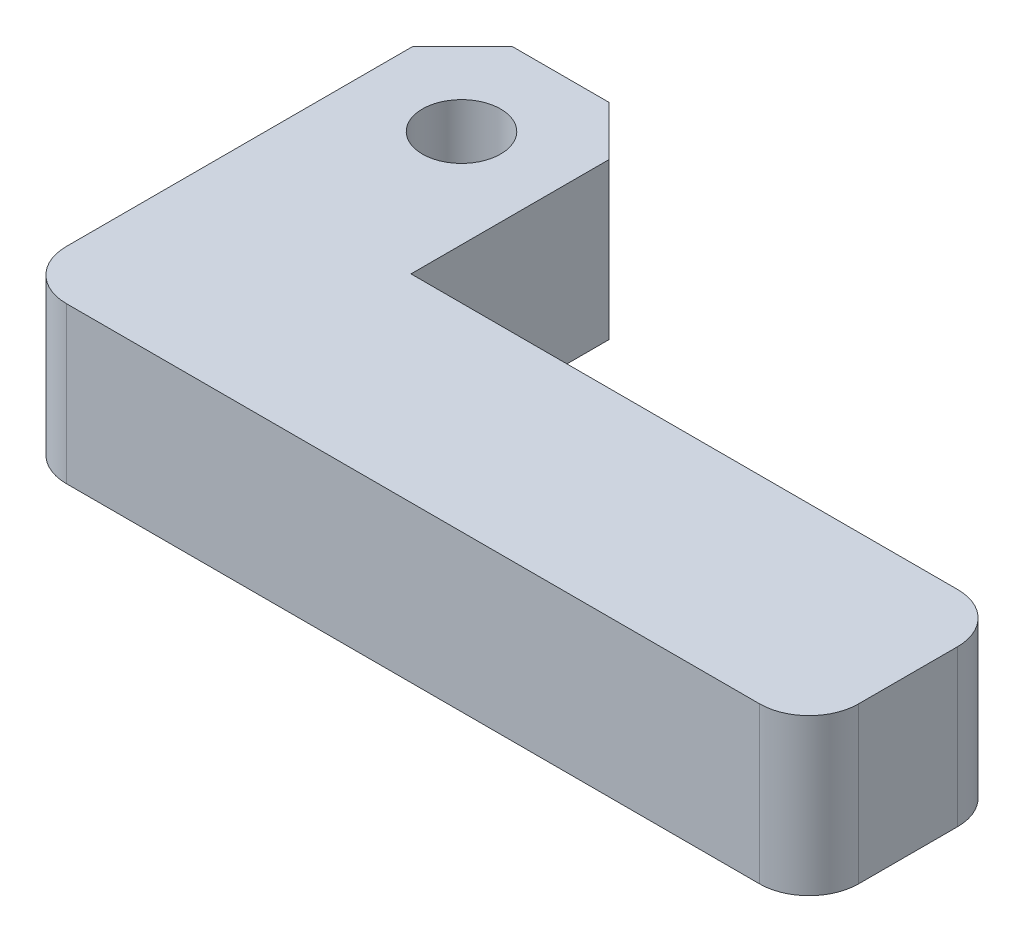
ISO-10303-21;
HEADER;
FILE_DESCRIPTION(('STEP AP214'),'2;1');
FILE_NAME('part.step','',(''),(''),'','','');
FILE_SCHEMA(('AUTOMOTIVE_DESIGN { 1 0 10303 214 1 1 1 1 }'));
ENDSEC;
DATA;
#1=APPLICATION_CONTEXT('core data for automotive mechanical design processes');
#2=APPLICATION_PROTOCOL_DEFINITION('international standard','automotive_design',2000,#1);
#3=PRODUCT_CONTEXT('',#1,'mechanical');
#4=PRODUCT('Part','Part','',(#3));
#5=PRODUCT_RELATED_PRODUCT_CATEGORY('part','',(#4));
#6=PRODUCT_DEFINITION_FORMATION('','',#4);
#7=PRODUCT_DEFINITION_CONTEXT('part definition',#1,'design');
#8=PRODUCT_DEFINITION('design','',#6,#7);
#9=PRODUCT_DEFINITION_SHAPE('','',#8);
#10=(LENGTH_UNIT() NAMED_UNIT(*) SI_UNIT(.MILLI.,.METRE.));
#11=(NAMED_UNIT(*) PLANE_ANGLE_UNIT() SI_UNIT($,.RADIAN.));
#12=(NAMED_UNIT(*) SI_UNIT($,.STERADIAN.) SOLID_ANGLE_UNIT());
#13=UNCERTAINTY_MEASURE_WITH_UNIT(LENGTH_MEASURE(1.E-05),#10,'distance_accuracy_value','');
#14=(GEOMETRIC_REPRESENTATION_CONTEXT(3) GLOBAL_UNCERTAINTY_ASSIGNED_CONTEXT((#13)) GLOBAL_UNIT_ASSIGNED_CONTEXT((#10,
#11,#12)) REPRESENTATION_CONTEXT('',''));
#15=CARTESIAN_POINT('',(0.,0.,0.));
#16=DIRECTION('',(0.,0.,1.));
#17=DIRECTION('',(1.,0.,0.));
#18=AXIS2_PLACEMENT_3D('',#15,#16,#17);
#19=CARTESIAN_POINT('',(47.625,10.,-3.175));
#20=DIRECTION('',(0.,1.,0.));
#21=DIRECTION('',(0.,0.,1.));
#22=AXIS2_PLACEMENT_3D('',#19,#20,#21);
#23=PLANE('',#22);
#24=DIRECTION('',(-1.,0.,0.));
#25=VECTOR('',#24,1.);
#26=CARTESIAN_POINT('',(12.573,10.,-28.575));
#27=LINE('',#26,#25);
#28=CARTESIAN_POINT('',(9.39799999999999,10.,-28.575));
#29=VERTEX_POINT('',#28);
#30=CARTESIAN_POINT('',(3.175,10.,-28.575));
#31=VERTEX_POINT('',#30);
#32=EDGE_CURVE('E171',#29,#31,#27,.T.);
#33=ORIENTED_EDGE('',*,*,#32,.T.);
#34=DIRECTION('',(0.707106781186549,0.,-0.707106781186546));
#35=VECTOR('',#34,1.);
#36=CARTESIAN_POINT('',(12.7000000000001,10.,-38.1));
#37=LINE('',#36,#35);
#38=CARTESIAN_POINT('',(0.,10.,-25.4));
#39=VERTEX_POINT('',#38);
#40=EDGE_CURVE('E41',#31,#39,#37,.F.);
#41=ORIENTED_EDGE('',*,*,#40,.T.);
#42=DIRECTION('',(0.,0.,1.));
#43=VECTOR('',#42,1.);
#44=CARTESIAN_POINT('',(0.,10.,-28.575));
#45=LINE('',#44,#43);
#46=CARTESIAN_POINT('',(0.,10.,-3.175));
#47=VERTEX_POINT('',#46);
#48=EDGE_CURVE('E128',#39,#47,#45,.T.);
#49=ORIENTED_EDGE('',*,*,#48,.T.);
#50=CARTESIAN_POINT('',(3.175,10.,-3.175));
#51=DIRECTION('',(0.,1.,0.));
#52=DIRECTION('',(0.,0.,1.));
#53=AXIS2_PLACEMENT_3D('',#50,#51,#52);
#54=CIRCLE('',#53,3.175);
#55=CARTESIAN_POINT('',(3.175,10.,0.));
#56=VERTEX_POINT('',#55);
#57=EDGE_CURVE('E124',#47,#56,#54,.T.);
#58=ORIENTED_EDGE('',*,*,#57,.T.);
#59=DIRECTION('',(1.,0.,0.));
#60=VECTOR('',#59,1.);
#61=CARTESIAN_POINT('',(0.,10.,0.));
#62=LINE('',#61,#60);
#63=CARTESIAN_POINT('',(47.625,10.,0.));
#64=VERTEX_POINT('',#63);
#65=EDGE_CURVE('E117',#56,#64,#62,.T.);
#66=ORIENTED_EDGE('',*,*,#65,.T.);
#67=CARTESIAN_POINT('',(47.625,10.,-3.175));
#68=DIRECTION('',(0.,1.,0.));
#69=DIRECTION('',(0.,0.,1.));
#70=AXIS2_PLACEMENT_3D('',#67,#68,#69);
#71=CIRCLE('',#70,3.175);
#72=CARTESIAN_POINT('',(50.8,10.,-3.175));
#73=VERTEX_POINT('',#72);
#74=EDGE_CURVE('E121',#64,#73,#71,.T.);
#75=ORIENTED_EDGE('',*,*,#74,.T.);
#76=DIRECTION('',(0.,0.,-1.));
#77=VECTOR('',#76,1.);
#78=CARTESIAN_POINT('',(50.8,10.,-3.175));
#79=LINE('',#78,#77);
#80=CARTESIAN_POINT('',(50.8,10.,-9.525));
#81=VERTEX_POINT('',#80);
#82=EDGE_CURVE('E143',#73,#81,#79,.T.);
#83=ORIENTED_EDGE('',*,*,#82,.T.);
#84=CARTESIAN_POINT('',(47.625,10.,-9.525));
#85=DIRECTION('',(0.,1.,0.));
#86=DIRECTION('',(0.,0.,1.));
#87=AXIS2_PLACEMENT_3D('',#84,#85,#86);
#88=CIRCLE('',#87,3.175);
#89=CARTESIAN_POINT('',(47.625,10.,-12.7));
#90=VERTEX_POINT('',#89);
#91=EDGE_CURVE('E145',#81,#90,#88,.T.);
#92=ORIENTED_EDGE('',*,*,#91,.T.);
#93=DIRECTION('',(-1.,0.,0.));
#94=VECTOR('',#93,1.);
#95=CARTESIAN_POINT('',(47.625,10.,-12.7));
#96=LINE('',#95,#94);
#97=CARTESIAN_POINT('',(12.573,10.,-12.7));
#98=VERTEX_POINT('',#97);
#99=EDGE_CURVE('E150',#90,#98,#96,.T.);
#100=ORIENTED_EDGE('',*,*,#99,.T.);
#101=DIRECTION('',(0.,0.,-1.));
#102=VECTOR('',#101,1.);
#103=CARTESIAN_POINT('',(12.573,10.,-12.7));
#104=LINE('',#103,#102);
#105=CARTESIAN_POINT('',(12.573,10.,-25.4));
#106=VERTEX_POINT('',#105);
#107=EDGE_CURVE('E152',#98,#106,#104,.T.);
#108=ORIENTED_EDGE('',*,*,#107,.T.);
#109=DIRECTION('',(0.707106781186546,0.,0.707106781186549));
#110=VECTOR('',#109,1.);
#111=CARTESIAN_POINT('',(41.2114999999999,10.,3.23850000000007));
#112=LINE('',#111,#110);
#113=EDGE_CURVE('E200',#106,#29,#112,.F.);
#114=ORIENTED_EDGE('',*,*,#113,.T.);
#115=EDGE_LOOP('',(#33,#41,#49,#58,#66,#75,#83,#92,#100,#108,#114));
#116=FACE_BOUND('',#115,.T.);
#117=CARTESIAN_POINT('',(6.2865,10.,-22.225));
#118=DIRECTION('',(0.,1.,0.));
#119=DIRECTION('',(0.,0.,1.));
#120=AXIS2_PLACEMENT_3D('',#117,#118,#119);
#121=CIRCLE('',#120,2.50825);
#122=CARTESIAN_POINT('',(6.2865,10.,-19.71675));
#123=VERTEX_POINT('',#122);
#124=EDGE_CURVE('E158',#123,#123,#121,.T.);
#125=ORIENTED_EDGE('',*,*,#124,.F.);
#126=EDGE_LOOP('',(#125));
#127=FACE_BOUND('',#126,.T.);
#128=ADVANCED_FACE('F33',(#116,#127),#23,.T.);
#129=CARTESIAN_POINT('',(47.625,0.,-3.175));
#130=DIRECTION('',(0.,1.,0.));
#131=DIRECTION('',(0.,0.,1.));
#132=AXIS2_PLACEMENT_3D('',#129,#130,#131);
#133=PLANE('',#132);
#134=DIRECTION('',(0.,0.,1.));
#135=VECTOR('',#134,1.);
#136=CARTESIAN_POINT('',(0.,0.,-28.575));
#137=LINE('',#136,#135);
#138=CARTESIAN_POINT('',(0.,0.,-25.4));
#139=VERTEX_POINT('',#138);
#140=CARTESIAN_POINT('',(0.,0.,-3.175));
#141=VERTEX_POINT('',#140);
#142=EDGE_CURVE('E157',#139,#141,#137,.T.);
#143=ORIENTED_EDGE('',*,*,#142,.F.);
#144=DIRECTION('',(-0.707106781186549,0.,0.707106781186546));
#145=VECTOR('',#144,1.);
#146=CARTESIAN_POINT('',(0.,0.,-25.4));
#147=LINE('',#146,#145);
#148=CARTESIAN_POINT('',(3.175,0.,-28.575));
#149=VERTEX_POINT('',#148);
#150=EDGE_CURVE('E194',#139,#149,#147,.F.);
#151=ORIENTED_EDGE('',*,*,#150,.T.);
#152=DIRECTION('',(-1.,0.,0.));
#153=VECTOR('',#152,1.);
#154=CARTESIAN_POINT('',(12.573,0.,-28.575));
#155=LINE('',#154,#153);
#156=CARTESIAN_POINT('',(9.39799999999999,0.,-28.575));
#157=VERTEX_POINT('',#156);
#158=EDGE_CURVE('E155',#157,#149,#155,.T.);
#159=ORIENTED_EDGE('',*,*,#158,.F.);
#160=DIRECTION('',(-0.707106781186546,0.,-0.707106781186549));
#161=VECTOR('',#160,1.);
#162=CARTESIAN_POINT('',(9.39799999999999,0.,-28.575));
#163=LINE('',#162,#161);
#164=CARTESIAN_POINT('',(12.573,0.,-25.4));
#165=VERTEX_POINT('',#164);
#166=EDGE_CURVE('E192',#157,#165,#163,.F.);
#167=ORIENTED_EDGE('',*,*,#166,.T.);
#168=DIRECTION('',(0.,0.,-1.));
#169=VECTOR('',#168,1.);
#170=CARTESIAN_POINT('',(12.573,0.,-12.7));
#171=LINE('',#170,#169);
#172=CARTESIAN_POINT('',(12.573,0.,-12.7));
#173=VERTEX_POINT('',#172);
#174=EDGE_CURVE('E169',#173,#165,#171,.T.);
#175=ORIENTED_EDGE('',*,*,#174,.F.);
#176=DIRECTION('',(-1.,0.,0.));
#177=VECTOR('',#176,1.);
#178=CARTESIAN_POINT('',(47.625,0.,-12.7));
#179=LINE('',#178,#177);
#180=CARTESIAN_POINT('',(47.625,0.,-12.7));
#181=VERTEX_POINT('',#180);
#182=EDGE_CURVE('E167',#181,#173,#179,.T.);
#183=ORIENTED_EDGE('',*,*,#182,.F.);
#184=CARTESIAN_POINT('',(47.625,0.,-9.525));
#185=DIRECTION('',(0.,1.,0.));
#186=DIRECTION('',(0.,0.,1.));
#187=AXIS2_PLACEMENT_3D('',#184,#185,#186);
#188=CIRCLE('',#187,3.175);
#189=CARTESIAN_POINT('',(50.8,0.,-9.525));
#190=VERTEX_POINT('',#189);
#191=EDGE_CURVE('E165',#190,#181,#188,.T.);
#192=ORIENTED_EDGE('',*,*,#191,.F.);
#193=DIRECTION('',(0.,0.,-1.));
#194=VECTOR('',#193,1.);
#195=CARTESIAN_POINT('',(50.8,0.,-3.175));
#196=LINE('',#195,#194);
#197=CARTESIAN_POINT('',(50.8,0.,-3.175));
#198=VERTEX_POINT('',#197);
#199=EDGE_CURVE('E163',#198,#190,#196,.T.);
#200=ORIENTED_EDGE('',*,*,#199,.F.);
#201=CARTESIAN_POINT('',(47.625,0.,-3.175));
#202=DIRECTION('',(0.,1.,0.));
#203=DIRECTION('',(0.,0.,1.));
#204=AXIS2_PLACEMENT_3D('',#201,#202,#203);
#205=CIRCLE('',#204,3.175);
#206=CARTESIAN_POINT('',(47.625,0.,0.));
#207=VERTEX_POINT('',#206);
#208=EDGE_CURVE('E161',#207,#198,#205,.T.);
#209=ORIENTED_EDGE('',*,*,#208,.F.);
#210=DIRECTION('',(1.,0.,0.));
#211=VECTOR('',#210,1.);
#212=CARTESIAN_POINT('',(0.,0.,0.));
#213=LINE('',#212,#211);
#214=CARTESIAN_POINT('',(3.175,0.,0.));
#215=VERTEX_POINT('',#214);
#216=EDGE_CURVE('E134',#215,#207,#213,.T.);
#217=ORIENTED_EDGE('',*,*,#216,.F.);
#218=CARTESIAN_POINT('',(3.175,0.,-3.175));
#219=DIRECTION('',(0.,1.,0.));
#220=DIRECTION('',(0.,0.,1.));
#221=AXIS2_PLACEMENT_3D('',#218,#219,#220);
#222=CIRCLE('',#221,3.175);
#223=EDGE_CURVE('E182',#215,#141,#222,.F.);
#224=ORIENTED_EDGE('',*,*,#223,.T.);
#225=EDGE_LOOP('',(#143,#151,#159,#167,#175,#183,#192,#200,#209,#217,#224));
#226=FACE_BOUND('',#225,.T.);
#227=CARTESIAN_POINT('',(6.2865,0.,-22.225));
#228=DIRECTION('',(0.,1.,0.));
#229=DIRECTION('',(0.,0.,1.));
#230=AXIS2_PLACEMENT_3D('',#227,#228,#229);
#231=CIRCLE('',#230,2.50825);
#232=CARTESIAN_POINT('',(6.2865,0.,-19.71675));
#233=VERTEX_POINT('',#232);
#234=EDGE_CURVE('E353',#233,#233,#231,.T.);
#235=ORIENTED_EDGE('',*,*,#234,.T.);
#236=EDGE_LOOP('',(#235));
#237=FACE_BOUND('',#236,.T.);
#238=ADVANCED_FACE('F212',(#226,#237),#133,.F.);
#239=CARTESIAN_POINT('',(12.573,10.,-28.575));
#240=DIRECTION('',(0.,0.,1.));
#241=DIRECTION('',(1.,0.,0.));
#242=AXIS2_PLACEMENT_3D('',#239,#240,#241);
#243=PLANE('',#242);
#244=ORIENTED_EDGE('',*,*,#158,.T.);
#245=DIRECTION('',(0.,1.,0.));
#246=VECTOR('',#245,1.);
#247=CARTESIAN_POINT('',(3.175,10.,-28.575));
#248=LINE('',#247,#246);
#249=EDGE_CURVE('E54',#149,#31,#248,.T.);
#250=ORIENTED_EDGE('',*,*,#249,.T.);
#251=ORIENTED_EDGE('',*,*,#32,.F.);
#252=DIRECTION('',(0.,-1.,0.));
#253=VECTOR('',#252,1.);
#254=CARTESIAN_POINT('',(9.39799999999999,10.,-28.575));
#255=LINE('',#254,#253);
#256=EDGE_CURVE('E196',#29,#157,#255,.T.);
#257=ORIENTED_EDGE('',*,*,#256,.T.);
#258=EDGE_LOOP('',(#244,#250,#251,#257));
#259=FACE_BOUND('',#258,.T.);
#260=ADVANCED_FACE('F214',(#259),#243,.F.);
#261=CARTESIAN_POINT('',(0.,10.,-28.575));
#262=DIRECTION('',(1.,0.,0.));
#263=DIRECTION('',(0.,0.,-1.));
#264=AXIS2_PLACEMENT_3D('',#261,#262,#263);
#265=PLANE('',#264);
#266=ORIENTED_EDGE('',*,*,#48,.F.);
#267=DIRECTION('',(0.,-1.,0.));
#268=VECTOR('',#267,1.);
#269=CARTESIAN_POINT('',(0.,10.,-25.4));
#270=LINE('',#269,#268);
#271=EDGE_CURVE('E189',#39,#139,#270,.T.);
#272=ORIENTED_EDGE('',*,*,#271,.T.);
#273=ORIENTED_EDGE('',*,*,#142,.T.);
#274=DIRECTION('',(0.,-1.,0.));
#275=VECTOR('',#274,1.);
#276=CARTESIAN_POINT('',(0.,10.,-3.175));
#277=LINE('',#276,#275);
#278=EDGE_CURVE('E185',#141,#47,#277,.F.);
#279=ORIENTED_EDGE('',*,*,#278,.T.);
#280=EDGE_LOOP('',(#266,#272,#273,#279));
#281=FACE_BOUND('',#280,.T.);
#282=ADVANCED_FACE('F206',(#281),#265,.F.);
#283=CARTESIAN_POINT('',(0.,10.,0.));
#284=DIRECTION('',(0.,0.,-1.));
#285=DIRECTION('',(-1.,0.,0.));
#286=AXIS2_PLACEMENT_3D('',#283,#284,#285);
#287=PLANE('',#286);
#288=ORIENTED_EDGE('',*,*,#65,.F.);
#289=DIRECTION('',(0.,-1.,0.));
#290=VECTOR('',#289,1.);
#291=CARTESIAN_POINT('',(3.175,10.,0.));
#292=LINE('',#291,#290);
#293=EDGE_CURVE('E137',#56,#215,#292,.T.);
#294=ORIENTED_EDGE('',*,*,#293,.T.);
#295=ORIENTED_EDGE('',*,*,#216,.T.);
#296=DIRECTION('',(0.,-1.,0.));
#297=VECTOR('',#296,1.);
#298=CARTESIAN_POINT('',(47.625,10.,0.));
#299=LINE('',#298,#297);
#300=EDGE_CURVE('E131',#64,#207,#299,.T.);
#301=ORIENTED_EDGE('',*,*,#300,.F.);
#302=EDGE_LOOP('',(#288,#294,#295,#301));
#303=FACE_BOUND('',#302,.T.);
#304=ADVANCED_FACE('F132',(#303),#287,.F.);
#305=CARTESIAN_POINT('',(47.625,10.,-3.175));
#306=DIRECTION('',(0.,-1.,0.));
#307=DIRECTION('',(0.,0.,-1.));
#308=AXIS2_PLACEMENT_3D('',#305,#306,#307);
#309=CYLINDRICAL_SURFACE('',#308,3.175);
#310=ORIENTED_EDGE('',*,*,#208,.T.);
#311=DIRECTION('',(0.,-1.,0.));
#312=VECTOR('',#311,1.);
#313=CARTESIAN_POINT('',(50.8,10.,-3.175));
#314=LINE('',#313,#312);
#315=EDGE_CURVE('E138',#73,#198,#314,.T.);
#316=ORIENTED_EDGE('',*,*,#315,.F.);
#317=ORIENTED_EDGE('',*,*,#74,.F.);
#318=ORIENTED_EDGE('',*,*,#300,.T.);
#319=EDGE_LOOP('',(#310,#316,#317,#318));
#320=FACE_BOUND('',#319,.T.);
#321=ADVANCED_FACE('F140',(#320),#309,.T.);
#322=CARTESIAN_POINT('',(50.8,10.,-3.175));
#323=DIRECTION('',(-1.,0.,0.));
#324=DIRECTION('',(0.,0.,1.));
#325=AXIS2_PLACEMENT_3D('',#322,#323,#324);
#326=PLANE('',#325);
#327=ORIENTED_EDGE('',*,*,#199,.T.);
#328=DIRECTION('',(0.,-1.,0.));
#329=VECTOR('',#328,1.);
#330=CARTESIAN_POINT('',(50.8,10.,-9.525));
#331=LINE('',#330,#329);
#332=EDGE_CURVE('E177',#81,#190,#331,.T.);
#333=ORIENTED_EDGE('',*,*,#332,.F.);
#334=ORIENTED_EDGE('',*,*,#82,.F.);
#335=ORIENTED_EDGE('',*,*,#315,.T.);
#336=EDGE_LOOP('',(#327,#333,#334,#335));
#337=FACE_BOUND('',#336,.T.);
#338=ADVANCED_FACE('F233',(#337),#326,.F.);
#339=CARTESIAN_POINT('',(47.625,10.,-9.525));
#340=DIRECTION('',(0.,-1.,0.));
#341=DIRECTION('',(0.,0.,-1.));
#342=AXIS2_PLACEMENT_3D('',#339,#340,#341);
#343=CYLINDRICAL_SURFACE('',#342,3.175);
#344=ORIENTED_EDGE('',*,*,#191,.T.);
#345=DIRECTION('',(0.,-1.,0.));
#346=VECTOR('',#345,1.);
#347=CARTESIAN_POINT('',(47.625,10.,-12.7));
#348=LINE('',#347,#346);
#349=EDGE_CURVE('E174',#90,#181,#348,.T.);
#350=ORIENTED_EDGE('',*,*,#349,.F.);
#351=ORIENTED_EDGE('',*,*,#91,.F.);
#352=ORIENTED_EDGE('',*,*,#332,.T.);
#353=EDGE_LOOP('',(#344,#350,#351,#352));
#354=FACE_BOUND('',#353,.T.);
#355=ADVANCED_FACE('F229',(#354),#343,.T.);
#356=CARTESIAN_POINT('',(47.625,10.,-12.7));
#357=DIRECTION('',(0.,0.,1.));
#358=DIRECTION('',(1.,0.,0.));
#359=AXIS2_PLACEMENT_3D('',#356,#357,#358);
#360=PLANE('',#359);
#361=ORIENTED_EDGE('',*,*,#182,.T.);
#362=DIRECTION('',(0.,-1.,0.));
#363=VECTOR('',#362,1.);
#364=CARTESIAN_POINT('',(12.573,10.,-12.7));
#365=LINE('',#364,#363);
#366=EDGE_CURVE('E154',#98,#173,#365,.T.);
#367=ORIENTED_EDGE('',*,*,#366,.F.);
#368=ORIENTED_EDGE('',*,*,#99,.F.);
#369=ORIENTED_EDGE('',*,*,#349,.T.);
#370=EDGE_LOOP('',(#361,#367,#368,#369));
#371=FACE_BOUND('',#370,.T.);
#372=ADVANCED_FACE('F224',(#371),#360,.F.);
#373=CARTESIAN_POINT('',(12.573,10.,-12.7));
#374=DIRECTION('',(-1.,0.,0.));
#375=DIRECTION('',(0.,0.,1.));
#376=AXIS2_PLACEMENT_3D('',#373,#374,#375);
#377=PLANE('',#376);
#378=ORIENTED_EDGE('',*,*,#174,.T.);
#379=DIRECTION('',(0.,1.,0.));
#380=VECTOR('',#379,1.);
#381=CARTESIAN_POINT('',(12.573,10.,-25.4));
#382=LINE('',#381,#380);
#383=EDGE_CURVE('E11',#165,#106,#382,.T.);
#384=ORIENTED_EDGE('',*,*,#383,.T.);
#385=ORIENTED_EDGE('',*,*,#107,.F.);
#386=ORIENTED_EDGE('',*,*,#366,.T.);
#387=EDGE_LOOP('',(#378,#384,#385,#386));
#388=FACE_BOUND('',#387,.T.);
#389=ADVANCED_FACE('F220',(#388),#377,.F.);
#390=CARTESIAN_POINT('',(6.2865,10.,-22.225));
#391=DIRECTION('',(0.,-1.,0.));
#392=DIRECTION('',(0.,0.,-1.));
#393=AXIS2_PLACEMENT_3D('',#390,#391,#392);
#394=CYLINDRICAL_SURFACE('',#393,2.50825);
#395=ORIENTED_EDGE('',*,*,#124,.T.);
#396=EDGE_LOOP('',(#395));
#397=FACE_BOUND('',#396,.T.);
#398=ORIENTED_EDGE('',*,*,#234,.F.);
#399=EDGE_LOOP('',(#398));
#400=FACE_BOUND('',#399,.T.);
#401=ADVANCED_FACE('F249',(#397,#400),#394,.F.);
#402=CARTESIAN_POINT('',(3.175,10.,-3.175));
#403=DIRECTION('',(0.,-1.,0.));
#404=DIRECTION('',(0.,0.,-1.));
#405=AXIS2_PLACEMENT_3D('',#402,#403,#404);
#406=CYLINDRICAL_SURFACE('',#405,3.175);
#407=ORIENTED_EDGE('',*,*,#57,.F.);
#408=ORIENTED_EDGE('',*,*,#278,.F.);
#409=ORIENTED_EDGE('',*,*,#223,.F.);
#410=ORIENTED_EDGE('',*,*,#293,.F.);
#411=EDGE_LOOP('',(#407,#408,#409,#410));
#412=FACE_BOUND('',#411,.T.);
#413=ADVANCED_FACE('F270',(#412),#406,.T.);
#414=CARTESIAN_POINT('',(0.,10.,-25.4));
#415=DIRECTION('',(0.707106781186546,0.,0.707106781186549));
#416=DIRECTION('',(0.,-1.,0.));
#417=AXIS2_PLACEMENT_3D('',#414,#415,#416);
#418=PLANE('',#417);
#419=ORIENTED_EDGE('',*,*,#40,.F.);
#420=ORIENTED_EDGE('',*,*,#249,.F.);
#421=ORIENTED_EDGE('',*,*,#150,.F.);
#422=ORIENTED_EDGE('',*,*,#271,.F.);
#423=EDGE_LOOP('',(#419,#420,#421,#422));
#424=FACE_BOUND('',#423,.T.);
#425=ADVANCED_FACE('F209',(#424),#418,.F.);
#426=CARTESIAN_POINT('',(9.39799999999999,10.,-28.575));
#427=DIRECTION('',(-0.707106781186549,0.,0.707106781186546));
#428=DIRECTION('',(0.,-1.,0.));
#429=AXIS2_PLACEMENT_3D('',#426,#427,#428);
#430=PLANE('',#429);
#431=ORIENTED_EDGE('',*,*,#113,.F.);
#432=ORIENTED_EDGE('',*,*,#383,.F.);
#433=ORIENTED_EDGE('',*,*,#166,.F.);
#434=ORIENTED_EDGE('',*,*,#256,.F.);
#435=EDGE_LOOP('',(#431,#432,#433,#434));
#436=FACE_BOUND('',#435,.T.);
#437=ADVANCED_FACE('F35',(#436),#430,.F.);
#438=CLOSED_SHELL('',(#128,#238,#260,#282,#304,#321,#338,#355,#372,#389,#401,#413,#425,#437));
#439=MANIFOLD_SOLID_BREP('B2',#438);
#440=ADVANCED_BREP_SHAPE_REPRESENTATION('',(#18,#439),#14);
#441=SHAPE_DEFINITION_REPRESENTATION(#9,#440);
ENDSEC;
END-ISO-10303-21;
